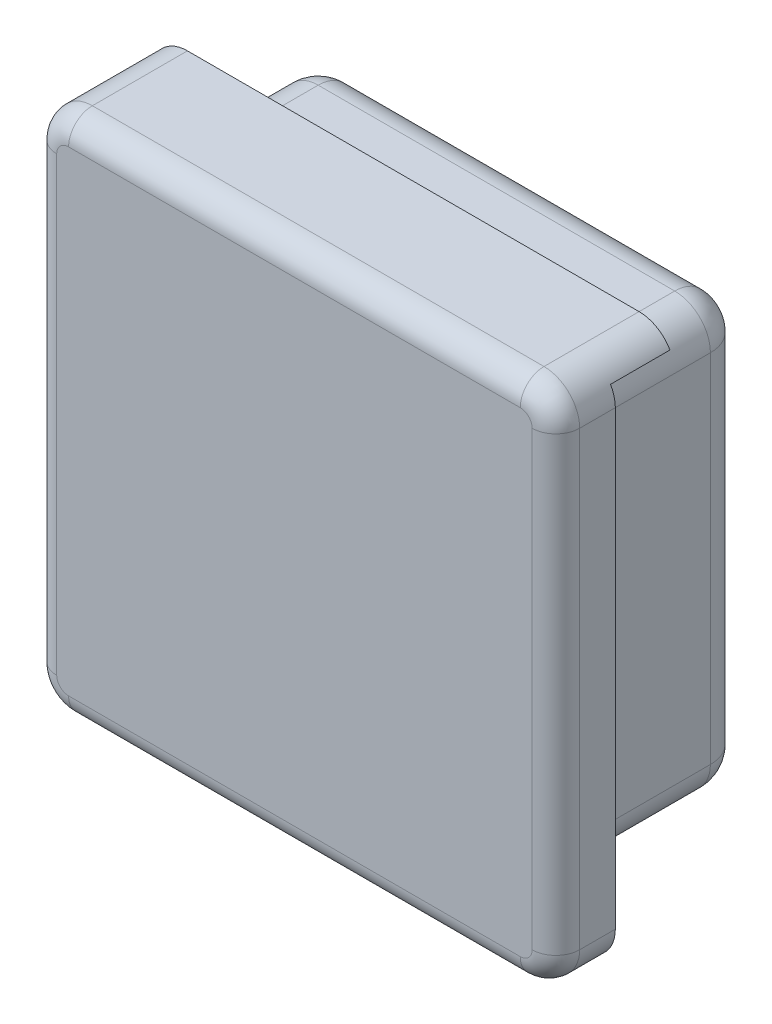
ISO-10303-21;
HEADER;
FILE_DESCRIPTION(('STEP AP214'),'2;1');
FILE_NAME('part.step','',(''),(''),'','','');
FILE_SCHEMA(('AUTOMOTIVE_DESIGN { 1 0 10303 214 1 1 1 1 }'));
ENDSEC;
DATA;
#1=APPLICATION_CONTEXT('core data for automotive mechanical design processes');
#2=APPLICATION_PROTOCOL_DEFINITION('international standard','automotive_design',2000,#1);
#3=PRODUCT_CONTEXT('',#1,'mechanical');
#4=PRODUCT('Part','Part','',(#3));
#5=PRODUCT_RELATED_PRODUCT_CATEGORY('part','',(#4));
#6=PRODUCT_DEFINITION_FORMATION('','',#4);
#7=PRODUCT_DEFINITION_CONTEXT('part definition',#1,'design');
#8=PRODUCT_DEFINITION('design','',#6,#7);
#9=PRODUCT_DEFINITION_SHAPE('','',#8);
#10=(LENGTH_UNIT() NAMED_UNIT(*) SI_UNIT(.MILLI.,.METRE.));
#11=(NAMED_UNIT(*) PLANE_ANGLE_UNIT() SI_UNIT($,.RADIAN.));
#12=(NAMED_UNIT(*) SI_UNIT($,.STERADIAN.) SOLID_ANGLE_UNIT());
#13=UNCERTAINTY_MEASURE_WITH_UNIT(LENGTH_MEASURE(1.E-05),#10,'distance_accuracy_value','');
#14=(GEOMETRIC_REPRESENTATION_CONTEXT(3) GLOBAL_UNCERTAINTY_ASSIGNED_CONTEXT((#13)) GLOBAL_UNIT_ASSIGNED_CONTEXT((#10,
#11,#12)) REPRESENTATION_CONTEXT('',''));
#15=CARTESIAN_POINT('',(0.,0.,0.));
#16=DIRECTION('',(0.,0.,1.));
#17=DIRECTION('',(1.,0.,0.));
#18=AXIS2_PLACEMENT_3D('',#15,#16,#17);
#19=CARTESIAN_POINT('',(0.,0.,0.));
#20=DIRECTION('',(0.,0.,-1.));
#21=DIRECTION('',(-1.,0.,0.));
#22=AXIS2_PLACEMENT_3D('',#19,#20,#21);
#23=PLANE('',#22);
#24=DIRECTION('',(-1.,0.,0.));
#25=VECTOR('',#24,1.);
#26=CARTESIAN_POINT('',(0.,44.,0.));
#27=LINE('',#26,#25);
#28=CARTESIAN_POINT('',(41.,44.,0.));
#29=VERTEX_POINT('',#28);
#30=CARTESIAN_POINT('',(3.,44.,0.));
#31=VERTEX_POINT('',#30);
#32=EDGE_CURVE('E240',#29,#31,#27,.T.);
#33=ORIENTED_EDGE('',*,*,#32,.F.);
#34=CARTESIAN_POINT('',(41.,41.,0.));
#35=DIRECTION('',(0.,0.,-1.));
#36=DIRECTION('',(-1.,0.,0.));
#37=AXIS2_PLACEMENT_3D('',#34,#35,#36);
#38=CIRCLE('',#37,3.);
#39=CARTESIAN_POINT('',(43.5980762113533,42.5,0.));
#40=VERTEX_POINT('',#39);
#41=EDGE_CURVE('E298',#29,#40,#38,.T.);
#42=ORIENTED_EDGE('',*,*,#41,.T.);
#43=DIRECTION('',(1.,0.,0.));
#44=VECTOR('',#43,1.);
#45=CARTESIAN_POINT('',(44.,42.5,0.));
#46=LINE('',#45,#44);
#47=CARTESIAN_POINT('',(4.5,42.5,0.));
#48=VERTEX_POINT('',#47);
#49=EDGE_CURVE('E421',#48,#40,#46,.T.);
#50=ORIENTED_EDGE('',*,*,#49,.F.);
#51=CARTESIAN_POINT('',(4.5,39.5,0.));
#52=DIRECTION('',(0.,0.,-1.));
#53=DIRECTION('',(-1.,0.,0.));
#54=AXIS2_PLACEMENT_3D('',#51,#52,#53);
#55=CIRCLE('',#54,3.);
#56=CARTESIAN_POINT('',(1.5,39.5,0.));
#57=VERTEX_POINT('',#56);
#58=EDGE_CURVE('E314',#48,#57,#55,.F.);
#59=ORIENTED_EDGE('',*,*,#58,.T.);
#60=DIRECTION('',(0.,1.,0.));
#61=VECTOR('',#60,1.);
#62=CARTESIAN_POINT('',(1.5,42.5,0.));
#63=LINE('',#62,#61);
#64=CARTESIAN_POINT('',(1.5,0.401923788646685,0.));
#65=VERTEX_POINT('',#64);
#66=EDGE_CURVE('E427',#65,#57,#63,.T.);
#67=ORIENTED_EDGE('',*,*,#66,.F.);
#68=CARTESIAN_POINT('',(3.,3.,0.));
#69=DIRECTION('',(0.,0.,-1.));
#70=DIRECTION('',(-1.,0.,0.));
#71=AXIS2_PLACEMENT_3D('',#68,#69,#70);
#72=CIRCLE('',#71,3.);
#73=CARTESIAN_POINT('',(0.,3.,0.));
#74=VERTEX_POINT('',#73);
#75=EDGE_CURVE('E296',#65,#74,#72,.T.);
#76=ORIENTED_EDGE('',*,*,#75,.T.);
#77=DIRECTION('',(0.,-1.,0.));
#78=VECTOR('',#77,1.);
#79=CARTESIAN_POINT('',(0.,0.,0.));
#80=LINE('',#79,#78);
#81=CARTESIAN_POINT('',(0.,41.,0.));
#82=VERTEX_POINT('',#81);
#83=EDGE_CURVE('E438',#82,#74,#80,.T.);
#84=ORIENTED_EDGE('',*,*,#83,.F.);
#85=CARTESIAN_POINT('',(3.,41.,0.));
#86=DIRECTION('',(0.,0.,-1.));
#87=DIRECTION('',(-1.,0.,0.));
#88=AXIS2_PLACEMENT_3D('',#85,#86,#87);
#89=CIRCLE('',#88,3.);
#90=EDGE_CURVE('E294',#82,#31,#89,.T.);
#91=ORIENTED_EDGE('',*,*,#90,.T.);
#92=EDGE_LOOP('',(#33,#42,#50,#59,#67,#76,#84,#91));
#93=FACE_BOUND('',#92,.T.);
#94=ADVANCED_FACE('F35',(#93),#23,.T.);
#95=CARTESIAN_POINT('',(0.,0.,10.));
#96=DIRECTION('',(1.,0.,0.));
#97=DIRECTION('',(0.,0.,-1.));
#98=AXIS2_PLACEMENT_3D('',#95,#96,#97);
#99=PLANE('',#98);
#100=DIRECTION('',(0.,0.,-1.));
#101=VECTOR('',#100,1.);
#102=CARTESIAN_POINT('',(0.,3.,10.));
#103=LINE('',#102,#101);
#104=CARTESIAN_POINT('',(0.,3.,8.));
#105=VERTEX_POINT('',#104);
#106=EDGE_CURVE('E311',#74,#105,#103,.F.);
#107=ORIENTED_EDGE('',*,*,#106,.T.);
#108=DIRECTION('',(0.,-1.,0.));
#109=VECTOR('',#108,1.);
#110=CARTESIAN_POINT('',(0.,0.,8.));
#111=LINE('',#110,#109);
#112=CARTESIAN_POINT('',(0.,41.,8.));
#113=VERTEX_POINT('',#112);
#114=EDGE_CURVE('E368',#105,#113,#111,.F.);
#115=ORIENTED_EDGE('',*,*,#114,.T.);
#116=DIRECTION('',(0.,0.,-1.));
#117=VECTOR('',#116,1.);
#118=CARTESIAN_POINT('',(0.,41.,10.));
#119=LINE('',#118,#117);
#120=EDGE_CURVE('E309',#113,#82,#119,.T.);
#121=ORIENTED_EDGE('',*,*,#120,.T.);
#122=ORIENTED_EDGE('',*,*,#83,.T.);
#123=EDGE_LOOP('',(#107,#115,#121,#122));
#124=FACE_BOUND('',#123,.T.);
#125=ADVANCED_FACE('F514',(#124),#99,.F.);
#126=CARTESIAN_POINT('',(0.,0.,10.));
#127=DIRECTION('',(0.,1.,0.));
#128=DIRECTION('',(0.,0.,1.));
#129=AXIS2_PLACEMENT_3D('',#126,#127,#128);
#130=PLANE('',#129);
#131=DIRECTION('',(0.,0.,-1.));
#132=VECTOR('',#131,1.);
#133=CARTESIAN_POINT('',(41.,0.,10.));
#134=LINE('',#133,#132);
#135=CARTESIAN_POINT('',(41.,0.,5.));
#136=VERTEX_POINT('',#135);
#137=CARTESIAN_POINT('',(41.,0.,8.));
#138=VERTEX_POINT('',#137);
#139=EDGE_CURVE('E287',#136,#138,#134,.F.);
#140=ORIENTED_EDGE('',*,*,#139,.T.);
#141=DIRECTION('',(1.,0.,0.));
#142=VECTOR('',#141,1.);
#143=CARTESIAN_POINT('',(0.,0.,8.));
#144=LINE('',#143,#142);
#145=CARTESIAN_POINT('',(3.,0.,8.));
#146=VERTEX_POINT('',#145);
#147=EDGE_CURVE('E11',#138,#146,#144,.F.);
#148=ORIENTED_EDGE('',*,*,#147,.T.);
#149=DIRECTION('',(0.,0.,-1.));
#150=VECTOR('',#149,1.);
#151=CARTESIAN_POINT('',(3.,0.,10.));
#152=LINE('',#151,#150);
#153=CARTESIAN_POINT('',(3.,0.,5.));
#154=VERTEX_POINT('',#153);
#155=EDGE_CURVE('E285',#146,#154,#152,.T.);
#156=ORIENTED_EDGE('',*,*,#155,.T.);
#157=DIRECTION('',(-1.,0.,0.));
#158=VECTOR('',#157,1.);
#159=CARTESIAN_POINT('',(1.5,0.,5.));
#160=LINE('',#159,#158);
#161=EDGE_CURVE('E420',#136,#154,#160,.T.);
#162=ORIENTED_EDGE('',*,*,#161,.F.);
#163=EDGE_LOOP('',(#140,#148,#156,#162));
#164=FACE_BOUND('',#163,.T.);
#165=ADVANCED_FACE('F520',(#164),#130,.F.);
#166=CARTESIAN_POINT('',(44.,0.,10.));
#167=DIRECTION('',(-1.,0.,0.));
#168=DIRECTION('',(0.,0.,1.));
#169=AXIS2_PLACEMENT_3D('',#166,#167,#168);
#170=PLANE('',#169);
#171=DIRECTION('',(0.,0.,-1.));
#172=VECTOR('',#171,1.);
#173=CARTESIAN_POINT('',(44.,41.,10.));
#174=LINE('',#173,#172);
#175=CARTESIAN_POINT('',(44.,41.,5.));
#176=VERTEX_POINT('',#175);
#177=CARTESIAN_POINT('',(44.,41.,8.));
#178=VERTEX_POINT('',#177);
#179=EDGE_CURVE('E273',#176,#178,#174,.F.);
#180=ORIENTED_EDGE('',*,*,#179,.T.);
#181=DIRECTION('',(0.,1.,0.));
#182=VECTOR('',#181,1.);
#183=CARTESIAN_POINT('',(44.,0.,8.));
#184=LINE('',#183,#182);
#185=CARTESIAN_POINT('',(44.,3.,8.));
#186=VERTEX_POINT('',#185);
#187=EDGE_CURVE('E59',#178,#186,#184,.F.);
#188=ORIENTED_EDGE('',*,*,#187,.T.);
#189=DIRECTION('',(0.,0.,-1.));
#190=VECTOR('',#189,1.);
#191=CARTESIAN_POINT('',(44.,3.,10.));
#192=LINE('',#191,#190);
#193=CARTESIAN_POINT('',(44.,3.,5.));
#194=VERTEX_POINT('',#193);
#195=EDGE_CURVE('E275',#186,#194,#192,.T.);
#196=ORIENTED_EDGE('',*,*,#195,.T.);
#197=DIRECTION('',(0.,-1.,0.));
#198=VECTOR('',#197,1.);
#199=CARTESIAN_POINT('',(44.,0.,5.));
#200=LINE('',#199,#198);
#201=EDGE_CURVE('E417',#176,#194,#200,.T.);
#202=ORIENTED_EDGE('',*,*,#201,.F.);
#203=EDGE_LOOP('',(#180,#188,#196,#202));
#204=FACE_BOUND('',#203,.T.);
#205=ADVANCED_FACE('F415',(#204),#170,.F.);
#206=CARTESIAN_POINT('',(0.,44.,10.));
#207=DIRECTION('',(0.,-1.,0.));
#208=DIRECTION('',(0.,0.,-1.));
#209=AXIS2_PLACEMENT_3D('',#206,#207,#208);
#210=PLANE('',#209);
#211=DIRECTION('',(0.,0.,-1.));
#212=VECTOR('',#211,1.);
#213=CARTESIAN_POINT('',(3.,44.,10.));
#214=LINE('',#213,#212);
#215=CARTESIAN_POINT('',(3.,44.,8.));
#216=VERTEX_POINT('',#215);
#217=EDGE_CURVE('E289',#31,#216,#214,.F.);
#218=ORIENTED_EDGE('',*,*,#217,.T.);
#219=DIRECTION('',(-1.,0.,0.));
#220=VECTOR('',#219,1.);
#221=CARTESIAN_POINT('',(0.,44.,8.));
#222=LINE('',#221,#220);
#223=CARTESIAN_POINT('',(41.,44.,8.));
#224=VERTEX_POINT('',#223);
#225=EDGE_CURVE('E372',#216,#224,#222,.F.);
#226=ORIENTED_EDGE('',*,*,#225,.T.);
#227=DIRECTION('',(0.,0.,-1.));
#228=VECTOR('',#227,1.);
#229=CARTESIAN_POINT('',(41.,44.,10.));
#230=LINE('',#229,#228);
#231=EDGE_CURVE('E292',#224,#29,#230,.T.);
#232=ORIENTED_EDGE('',*,*,#231,.T.);
#233=ORIENTED_EDGE('',*,*,#32,.T.);
#234=EDGE_LOOP('',(#218,#226,#232,#233));
#235=FACE_BOUND('',#234,.T.);
#236=ADVANCED_FACE('F528',(#235),#210,.F.);
#237=CARTESIAN_POINT('',(0.,0.,10.));
#238=DIRECTION('',(0.,0.,-1.));
#239=DIRECTION('',(-1.,0.,0.));
#240=AXIS2_PLACEMENT_3D('',#237,#238,#239);
#241=PLANE('',#240);
#242=DIRECTION('',(0.,-1.,0.));
#243=VECTOR('',#242,1.);
#244=CARTESIAN_POINT('',(2.,0.,10.));
#245=LINE('',#244,#243);
#246=CARTESIAN_POINT('',(2.,41.,10.));
#247=VERTEX_POINT('',#246);
#248=CARTESIAN_POINT('',(2.,3.,10.));
#249=VERTEX_POINT('',#248);
#250=EDGE_CURVE('E360',#247,#249,#245,.T.);
#251=ORIENTED_EDGE('',*,*,#250,.T.);
#252=CARTESIAN_POINT('',(3.,3.,10.));
#253=DIRECTION('',(0.,0.,-1.));
#254=DIRECTION('',(-1.,0.,0.));
#255=AXIS2_PLACEMENT_3D('',#252,#253,#254);
#256=CIRCLE('',#255,1.);
#257=CARTESIAN_POINT('',(3.,2.,10.));
#258=VERTEX_POINT('',#257);
#259=EDGE_CURVE('E362',#249,#258,#256,.F.);
#260=ORIENTED_EDGE('',*,*,#259,.T.);
#261=DIRECTION('',(1.,0.,0.));
#262=VECTOR('',#261,1.);
#263=CARTESIAN_POINT('',(0.,2.,10.));
#264=LINE('',#263,#262);
#265=CARTESIAN_POINT('',(41.,2.,10.));
#266=VERTEX_POINT('',#265);
#267=EDGE_CURVE('E323',#258,#266,#264,.T.);
#268=ORIENTED_EDGE('',*,*,#267,.T.);
#269=CARTESIAN_POINT('',(41.,3.,10.));
#270=DIRECTION('',(0.,0.,-1.));
#271=DIRECTION('',(-1.,0.,0.));
#272=AXIS2_PLACEMENT_3D('',#269,#270,#271);
#273=CIRCLE('',#272,1.);
#274=CARTESIAN_POINT('',(42.,3.,10.));
#275=VERTEX_POINT('',#274);
#276=EDGE_CURVE('E350',#266,#275,#273,.F.);
#277=ORIENTED_EDGE('',*,*,#276,.T.);
#278=DIRECTION('',(0.,1.,0.));
#279=VECTOR('',#278,1.);
#280=CARTESIAN_POINT('',(42.,0.,10.));
#281=LINE('',#280,#279);
#282=CARTESIAN_POINT('',(42.,41.,10.));
#283=VERTEX_POINT('',#282);
#284=EDGE_CURVE('E352',#275,#283,#281,.T.);
#285=ORIENTED_EDGE('',*,*,#284,.T.);
#286=CARTESIAN_POINT('',(41.,41.,10.));
#287=DIRECTION('',(0.,0.,-1.));
#288=DIRECTION('',(-1.,0.,0.));
#289=AXIS2_PLACEMENT_3D('',#286,#287,#288);
#290=CIRCLE('',#289,1.);
#291=CARTESIAN_POINT('',(41.,42.,10.));
#292=VERTEX_POINT('',#291);
#293=EDGE_CURVE('E354',#283,#292,#290,.F.);
#294=ORIENTED_EDGE('',*,*,#293,.T.);
#295=DIRECTION('',(-1.,0.,0.));
#296=VECTOR('',#295,1.);
#297=CARTESIAN_POINT('',(0.,42.,10.));
#298=LINE('',#297,#296);
#299=CARTESIAN_POINT('',(3.,42.,10.));
#300=VERTEX_POINT('',#299);
#301=EDGE_CURVE('E356',#292,#300,#298,.T.);
#302=ORIENTED_EDGE('',*,*,#301,.T.);
#303=CARTESIAN_POINT('',(3.,41.,10.));
#304=DIRECTION('',(0.,0.,-1.));
#305=DIRECTION('',(-1.,0.,0.));
#306=AXIS2_PLACEMENT_3D('',#303,#304,#305);
#307=CIRCLE('',#306,1.);
#308=EDGE_CURVE('E358',#300,#247,#307,.F.);
#309=ORIENTED_EDGE('',*,*,#308,.T.);
#310=EDGE_LOOP('',(#251,#260,#268,#277,#285,#294,#302,#309));
#311=FACE_BOUND('',#310,.T.);
#312=ADVANCED_FACE('F526',(#311),#241,.F.);
#313=CARTESIAN_POINT('',(44.,42.5,5.));
#314=DIRECTION('',(0.,1.,0.));
#315=DIRECTION('',(0.,0.,1.));
#316=AXIS2_PLACEMENT_3D('',#313,#314,#315);
#317=PLANE('',#316);
#318=ORIENTED_EDGE('',*,*,#49,.T.);
#319=DIRECTION('',(0.,0.,-1.));
#320=VECTOR('',#319,1.);
#321=CARTESIAN_POINT('',(43.5980762113533,42.5,0.));
#322=LINE('',#321,#320);
#323=CARTESIAN_POINT('',(43.5980762113533,42.5,5.));
#324=VERTEX_POINT('',#323);
#325=EDGE_CURVE('E303',#40,#324,#322,.F.);
#326=ORIENTED_EDGE('',*,*,#325,.T.);
#327=DIRECTION('',(1.,0.,0.));
#328=VECTOR('',#327,1.);
#329=CARTESIAN_POINT('',(44.,42.5,5.));
#330=LINE('',#329,#328);
#331=CARTESIAN_POINT('',(4.5,42.5,5.));
#332=VERTEX_POINT('',#331);
#333=EDGE_CURVE('E435',#332,#324,#330,.T.);
#334=ORIENTED_EDGE('',*,*,#333,.F.);
#335=DIRECTION('',(0.,0.,-1.));
#336=VECTOR('',#335,1.);
#337=CARTESIAN_POINT('',(4.5,42.5,0.));
#338=LINE('',#337,#336);
#339=EDGE_CURVE('E300',#332,#48,#338,.T.);
#340=ORIENTED_EDGE('',*,*,#339,.T.);
#341=EDGE_LOOP('',(#318,#326,#334,#340));
#342=FACE_BOUND('',#341,.T.);
#343=ADVANCED_FACE('F806',(#342),#317,.F.);
#344=CARTESIAN_POINT('',(1.5,42.5,5.));
#345=DIRECTION('',(-1.,0.,0.));
#346=DIRECTION('',(0.,-1.,0.));
#347=AXIS2_PLACEMENT_3D('',#344,#345,#346);
#348=PLANE('',#347);
#349=DIRECTION('',(0.,1.,0.));
#350=VECTOR('',#349,1.);
#351=CARTESIAN_POINT('',(1.5,42.5,5.));
#352=LINE('',#351,#350);
#353=CARTESIAN_POINT('',(1.5,0.401923788646688,5.));
#354=VERTEX_POINT('',#353);
#355=CARTESIAN_POINT('',(1.5,39.5,5.));
#356=VERTEX_POINT('',#355);
#357=EDGE_CURVE('E424',#354,#356,#352,.T.);
#358=ORIENTED_EDGE('',*,*,#357,.F.);
#359=DIRECTION('',(0.,0.,-1.));
#360=VECTOR('',#359,1.);
#361=CARTESIAN_POINT('',(1.5,0.401923788646687,5.));
#362=LINE('',#361,#360);
#363=EDGE_CURVE('E307',#354,#65,#362,.T.);
#364=ORIENTED_EDGE('',*,*,#363,.T.);
#365=ORIENTED_EDGE('',*,*,#66,.T.);
#366=DIRECTION('',(0.,0.,-1.));
#367=VECTOR('',#366,1.);
#368=CARTESIAN_POINT('',(1.5,39.5,5.));
#369=LINE('',#368,#367);
#370=EDGE_CURVE('E305',#57,#356,#369,.F.);
#371=ORIENTED_EDGE('',*,*,#370,.T.);
#372=EDGE_LOOP('',(#358,#364,#365,#371));
#373=FACE_BOUND('',#372,.T.);
#374=ADVANCED_FACE('F798',(#373),#348,.F.);
#375=CARTESIAN_POINT('',(0.,0.,5.));
#376=DIRECTION('',(0.,0.,1.));
#377=DIRECTION('',(1.,0.,0.));
#378=AXIS2_PLACEMENT_3D('',#375,#376,#377);
#379=PLANE('',#378);
#380=DIRECTION('',(0.,-1.,0.));
#381=VECTOR('',#380,1.);
#382=CARTESIAN_POINT('',(40.,4.,5.));
#383=LINE('',#382,#381);
#384=CARTESIAN_POINT('',(40.,37.,5.));
#385=VERTEX_POINT('',#384);
#386=CARTESIAN_POINT('',(40.,7.,5.));
#387=VERTEX_POINT('',#386);
#388=EDGE_CURVE('E348',#385,#387,#383,.T.);
#389=ORIENTED_EDGE('',*,*,#388,.F.);
#390=CARTESIAN_POINT('',(37.,37.,5.));
#391=DIRECTION('',(0.,0.,1.));
#392=DIRECTION('',(1.,0.,0.));
#393=AXIS2_PLACEMENT_3D('',#390,#391,#392);
#394=CIRCLE('',#393,3.);
#395=CARTESIAN_POINT('',(37.,40.,5.));
#396=VERTEX_POINT('',#395);
#397=EDGE_CURVE('E322',#385,#396,#394,.T.);
#398=ORIENTED_EDGE('',*,*,#397,.T.);
#399=DIRECTION('',(1.,0.,0.));
#400=VECTOR('',#399,1.);
#401=CARTESIAN_POINT('',(40.,40.,5.));
#402=LINE('',#401,#400);
#403=CARTESIAN_POINT('',(7.00000000000001,40.,5.));
#404=VERTEX_POINT('',#403);
#405=EDGE_CURVE('E430',#404,#396,#402,.T.);
#406=ORIENTED_EDGE('',*,*,#405,.F.);
#407=CARTESIAN_POINT('',(7.00000000000001,37.,5.));
#408=DIRECTION('',(0.,0.,1.));
#409=DIRECTION('',(1.,0.,0.));
#410=AXIS2_PLACEMENT_3D('',#407,#408,#409);
#411=CIRCLE('',#410,3.);
#412=CARTESIAN_POINT('',(4.,37.,5.));
#413=VERTEX_POINT('',#412);
#414=EDGE_CURVE('E318',#404,#413,#411,.T.);
#415=ORIENTED_EDGE('',*,*,#414,.T.);
#416=DIRECTION('',(0.,1.,0.));
#417=VECTOR('',#416,1.);
#418=CARTESIAN_POINT('',(4.,40.,5.));
#419=LINE('',#418,#417);
#420=CARTESIAN_POINT('',(4.,7.,5.));
#421=VERTEX_POINT('',#420);
#422=EDGE_CURVE('E486',#421,#413,#419,.T.);
#423=ORIENTED_EDGE('',*,*,#422,.F.);
#424=CARTESIAN_POINT('',(7.,7.,5.));
#425=DIRECTION('',(0.,0.,1.));
#426=DIRECTION('',(1.,0.,0.));
#427=AXIS2_PLACEMENT_3D('',#424,#425,#426);
#428=CIRCLE('',#427,3.);
#429=CARTESIAN_POINT('',(7.,4.,5.));
#430=VERTEX_POINT('',#429);
#431=EDGE_CURVE('E316',#421,#430,#428,.T.);
#432=ORIENTED_EDGE('',*,*,#431,.T.);
#433=DIRECTION('',(-1.,0.,0.));
#434=VECTOR('',#433,1.);
#435=CARTESIAN_POINT('',(4.,4.,5.));
#436=LINE('',#435,#434);
#437=CARTESIAN_POINT('',(37.,4.,5.));
#438=VERTEX_POINT('',#437);
#439=EDGE_CURVE('E483',#438,#430,#436,.T.);
#440=ORIENTED_EDGE('',*,*,#439,.F.);
#441=CARTESIAN_POINT('',(37.,7.,5.));
#442=DIRECTION('',(0.,0.,1.));
#443=DIRECTION('',(1.,0.,0.));
#444=AXIS2_PLACEMENT_3D('',#441,#442,#443);
#445=CIRCLE('',#444,3.);
#446=EDGE_CURVE('E320',#438,#387,#445,.T.);
#447=ORIENTED_EDGE('',*,*,#446,.T.);
#448=EDGE_LOOP('',(#389,#398,#406,#415,#423,#432,#440,#447));
#449=FACE_BOUND('',#448,.T.);
#450=ORIENTED_EDGE('',*,*,#201,.T.);
#451=CARTESIAN_POINT('',(41.,3.,5.));
#452=DIRECTION('',(0.,0.,1.));
#453=DIRECTION('',(1.,0.,0.));
#454=AXIS2_PLACEMENT_3D('',#451,#452,#453);
#455=CIRCLE('',#454,3.);
#456=EDGE_CURVE('E283',#194,#136,#455,.F.);
#457=ORIENTED_EDGE('',*,*,#456,.T.);
#458=ORIENTED_EDGE('',*,*,#161,.T.);
#459=CARTESIAN_POINT('',(3.,3.,5.));
#460=DIRECTION('',(0.,0.,1.));
#461=DIRECTION('',(1.,0.,0.));
#462=AXIS2_PLACEMENT_3D('',#459,#460,#461);
#463=CIRCLE('',#462,3.);
#464=EDGE_CURVE('E279',#154,#354,#463,.F.);
#465=ORIENTED_EDGE('',*,*,#464,.T.);
#466=ORIENTED_EDGE('',*,*,#357,.T.);
#467=CARTESIAN_POINT('',(4.5,39.5,5.));
#468=DIRECTION('',(0.,0.,1.));
#469=DIRECTION('',(1.,0.,0.));
#470=AXIS2_PLACEMENT_3D('',#467,#468,#469);
#471=CIRCLE('',#470,3.);
#472=EDGE_CURVE('E277',#356,#332,#471,.F.);
#473=ORIENTED_EDGE('',*,*,#472,.T.);
#474=ORIENTED_EDGE('',*,*,#333,.T.);
#475=CARTESIAN_POINT('',(41.,41.,5.));
#476=DIRECTION('',(0.,0.,1.));
#477=DIRECTION('',(1.,0.,0.));
#478=AXIS2_PLACEMENT_3D('',#475,#476,#477);
#479=CIRCLE('',#478,3.);
#480=EDGE_CURVE('E281',#324,#176,#479,.F.);
#481=ORIENTED_EDGE('',*,*,#480,.T.);
#482=EDGE_LOOP('',(#450,#457,#458,#465,#466,#473,#474,#481));
#483=FACE_BOUND('',#482,.T.);
#484=ADVANCED_FACE('F480',(#449,#483),#379,.F.);
#485=CARTESIAN_POINT('',(0.,0.,-10.));
#486=DIRECTION('',(0.,0.,1.));
#487=DIRECTION('',(1.,0.,0.));
#488=AXIS2_PLACEMENT_3D('',#485,#486,#487);
#489=PLANE('',#488);
#490=DIRECTION('',(0.,1.,0.));
#491=VECTOR('',#490,1.);
#492=CARTESIAN_POINT('',(7.,0.,-10.));
#493=LINE('',#492,#491);
#494=CARTESIAN_POINT('',(7.,7.,-10.));
#495=VERTEX_POINT('',#494);
#496=CARTESIAN_POINT('',(7.,37.,-10.));
#497=VERTEX_POINT('',#496);
#498=EDGE_CURVE('E244',#495,#497,#493,.T.);
#499=ORIENTED_EDGE('',*,*,#498,.T.);
#500=DIRECTION('',(1.,0.,0.));
#501=VECTOR('',#500,1.);
#502=CARTESIAN_POINT('',(0.,37.,-10.));
#503=LINE('',#502,#501);
#504=CARTESIAN_POINT('',(37.,37.,-10.));
#505=VERTEX_POINT('',#504);
#506=EDGE_CURVE('E215',#497,#505,#503,.T.);
#507=ORIENTED_EDGE('',*,*,#506,.T.);
#508=DIRECTION('',(0.,-1.,0.));
#509=VECTOR('',#508,1.);
#510=CARTESIAN_POINT('',(37.,0.,-10.));
#511=LINE('',#510,#509);
#512=CARTESIAN_POINT('',(37.,7.,-10.));
#513=VERTEX_POINT('',#512);
#514=EDGE_CURVE('E233',#505,#513,#511,.T.);
#515=ORIENTED_EDGE('',*,*,#514,.T.);
#516=DIRECTION('',(-1.,0.,0.));
#517=VECTOR('',#516,1.);
#518=CARTESIAN_POINT('',(0.,7.,-10.));
#519=LINE('',#518,#517);
#520=EDGE_CURVE('E239',#513,#495,#519,.T.);
#521=ORIENTED_EDGE('',*,*,#520,.T.);
#522=EDGE_LOOP('',(#499,#507,#515,#521));
#523=FACE_BOUND('',#522,.T.);
#524=ADVANCED_FACE('F242',(#523),#489,.F.);
#525=CARTESIAN_POINT('',(40.,40.,-10.));
#526=DIRECTION('',(0.,-1.,0.));
#527=DIRECTION('',(0.,0.,-1.));
#528=AXIS2_PLACEMENT_3D('',#525,#526,#527);
#529=PLANE('',#528);
#530=DIRECTION('',(1.,0.,0.));
#531=VECTOR('',#530,1.);
#532=CARTESIAN_POINT('',(40.,40.,-7.));
#533=LINE('',#532,#531);
#534=CARTESIAN_POINT('',(37.,40.,-7.));
#535=VERTEX_POINT('',#534);
#536=CARTESIAN_POINT('',(7.00000000000001,40.,-7.));
#537=VERTEX_POINT('',#536);
#538=EDGE_CURVE('E217',#535,#537,#533,.F.);
#539=ORIENTED_EDGE('',*,*,#538,.T.);
#540=DIRECTION('',(0.,0.,1.));
#541=VECTOR('',#540,1.);
#542=CARTESIAN_POINT('',(7.00000000000001,40.,-10.));
#543=LINE('',#542,#541);
#544=EDGE_CURVE('E253',#537,#404,#543,.T.);
#545=ORIENTED_EDGE('',*,*,#544,.T.);
#546=ORIENTED_EDGE('',*,*,#405,.T.);
#547=DIRECTION('',(0.,0.,1.));
#548=VECTOR('',#547,1.);
#549=CARTESIAN_POINT('',(37.,40.,-10.));
#550=LINE('',#549,#548);
#551=EDGE_CURVE('E246',#396,#535,#550,.F.);
#552=ORIENTED_EDGE('',*,*,#551,.T.);
#553=EDGE_LOOP('',(#539,#545,#546,#552));
#554=FACE_BOUND('',#553,.T.);
#555=ADVANCED_FACE('F468',(#554),#529,.F.);
#556=CARTESIAN_POINT('',(4.,4.,-10.));
#557=DIRECTION('',(1.,0.,0.));
#558=DIRECTION('',(0.,1.,0.));
#559=AXIS2_PLACEMENT_3D('',#556,#557,#558);
#560=PLANE('',#559);
#561=DIRECTION('',(0.,1.,0.));
#562=VECTOR('',#561,1.);
#563=CARTESIAN_POINT('',(4.,4.,-7.));
#564=LINE('',#563,#562);
#565=CARTESIAN_POINT('',(4.,37.,-7.));
#566=VERTEX_POINT('',#565);
#567=CARTESIAN_POINT('',(4.,7.,-7.));
#568=VERTEX_POINT('',#567);
#569=EDGE_CURVE('E257',#566,#568,#564,.F.);
#570=ORIENTED_EDGE('',*,*,#569,.T.);
#571=DIRECTION('',(0.,0.,1.));
#572=VECTOR('',#571,1.);
#573=CARTESIAN_POINT('',(4.,7.,-10.));
#574=LINE('',#573,#572);
#575=EDGE_CURVE('E259',#568,#421,#574,.T.);
#576=ORIENTED_EDGE('',*,*,#575,.T.);
#577=ORIENTED_EDGE('',*,*,#422,.T.);
#578=DIRECTION('',(0.,0.,1.));
#579=VECTOR('',#578,1.);
#580=CARTESIAN_POINT('',(4.,37.,-10.));
#581=LINE('',#580,#579);
#582=EDGE_CURVE('E255',#413,#566,#581,.F.);
#583=ORIENTED_EDGE('',*,*,#582,.T.);
#584=EDGE_LOOP('',(#570,#576,#577,#583));
#585=FACE_BOUND('',#584,.T.);
#586=ADVANCED_FACE('F491',(#585),#560,.F.);
#587=CARTESIAN_POINT('',(40.,4.,-10.));
#588=DIRECTION('',(0.,1.,0.));
#589=DIRECTION('',(0.,0.,1.));
#590=AXIS2_PLACEMENT_3D('',#587,#588,#589);
#591=PLANE('',#590);
#592=ORIENTED_EDGE('',*,*,#439,.T.);
#593=DIRECTION('',(0.,0.,1.));
#594=VECTOR('',#593,1.);
#595=CARTESIAN_POINT('',(7.,4.,-10.));
#596=LINE('',#595,#594);
#597=CARTESIAN_POINT('',(7.,4.,-7.));
#598=VERTEX_POINT('',#597);
#599=EDGE_CURVE('E265',#430,#598,#596,.F.);
#600=ORIENTED_EDGE('',*,*,#599,.T.);
#601=DIRECTION('',(-1.,0.,0.));
#602=VECTOR('',#601,1.);
#603=CARTESIAN_POINT('',(40.,4.,-7.));
#604=LINE('',#603,#602);
#605=CARTESIAN_POINT('',(37.,4.,-7.));
#606=VERTEX_POINT('',#605);
#607=EDGE_CURVE('E263',#598,#606,#604,.F.);
#608=ORIENTED_EDGE('',*,*,#607,.T.);
#609=DIRECTION('',(0.,0.,1.));
#610=VECTOR('',#609,1.);
#611=CARTESIAN_POINT('',(37.,4.,-10.));
#612=LINE('',#611,#610);
#613=EDGE_CURVE('E261',#606,#438,#612,.T.);
#614=ORIENTED_EDGE('',*,*,#613,.T.);
#615=EDGE_LOOP('',(#592,#600,#608,#614));
#616=FACE_BOUND('',#615,.T.);
#617=ADVANCED_FACE('F498',(#616),#591,.F.);
#618=CARTESIAN_POINT('',(40.,4.,-10.));
#619=DIRECTION('',(-1.,0.,0.));
#620=DIRECTION('',(0.,0.,1.));
#621=AXIS2_PLACEMENT_3D('',#618,#619,#620);
#622=PLANE('',#621);
#623=ORIENTED_EDGE('',*,*,#388,.T.);
#624=DIRECTION('',(0.,0.,1.));
#625=VECTOR('',#624,1.);
#626=CARTESIAN_POINT('',(40.,7.,-10.));
#627=LINE('',#626,#625);
#628=CARTESIAN_POINT('',(40.,7.,-7.));
#629=VERTEX_POINT('',#628);
#630=EDGE_CURVE('E271',#387,#629,#627,.F.);
#631=ORIENTED_EDGE('',*,*,#630,.T.);
#632=DIRECTION('',(0.,-1.,0.));
#633=VECTOR('',#632,1.);
#634=CARTESIAN_POINT('',(40.,4.,-7.));
#635=LINE('',#634,#633);
#636=CARTESIAN_POINT('',(40.,37.,-7.));
#637=VERTEX_POINT('',#636);
#638=EDGE_CURVE('E269',#629,#637,#635,.F.);
#639=ORIENTED_EDGE('',*,*,#638,.T.);
#640=DIRECTION('',(0.,0.,1.));
#641=VECTOR('',#640,1.);
#642=CARTESIAN_POINT('',(40.,37.,-10.));
#643=LINE('',#642,#641);
#644=EDGE_CURVE('E267',#637,#385,#643,.T.);
#645=ORIENTED_EDGE('',*,*,#644,.T.);
#646=EDGE_LOOP('',(#623,#631,#639,#645));
#647=FACE_BOUND('',#646,.T.);
#648=ADVANCED_FACE('F477',(#647),#622,.F.);
#649=CARTESIAN_POINT('',(7.,7.,-10.));
#650=DIRECTION('',(0.,0.,1.));
#651=DIRECTION('',(1.,0.,0.));
#652=AXIS2_PLACEMENT_3D('',#649,#650,#651);
#653=CYLINDRICAL_SURFACE('',#652,3.);
#654=ORIENTED_EDGE('',*,*,#431,.F.);
#655=ORIENTED_EDGE('',*,*,#575,.F.);
#656=CARTESIAN_POINT('',(7.,7.,-7.));
#657=DIRECTION('',(0.,0.,-1.));
#658=DIRECTION('',(-1.,0.,0.));
#659=AXIS2_PLACEMENT_3D('',#656,#657,#658);
#660=CIRCLE('',#659,3.);
#661=EDGE_CURVE('E345',#598,#568,#660,.T.);
#662=ORIENTED_EDGE('',*,*,#661,.F.);
#663=ORIENTED_EDGE('',*,*,#599,.F.);
#664=EDGE_LOOP('',(#654,#655,#662,#663));
#665=FACE_BOUND('',#664,.T.);
#666=ADVANCED_FACE('F496',(#665),#653,.T.);
#667=CARTESIAN_POINT('',(0.,7.,-7.));
#668=DIRECTION('',(-1.,0.,0.));
#669=DIRECTION('',(0.,0.,1.));
#670=AXIS2_PLACEMENT_3D('',#667,#668,#669);
#671=CYLINDRICAL_SURFACE('',#670,3.);
#672=CARTESIAN_POINT('',(37.,7.,-7.));
#673=DIRECTION('',(1.,0.,0.));
#674=DIRECTION('',(0.,0.,-1.));
#675=AXIS2_PLACEMENT_3D('',#672,#673,#674);
#676=CIRCLE('',#675,3.);
#677=EDGE_CURVE('E339',#606,#513,#676,.T.);
#678=ORIENTED_EDGE('',*,*,#677,.F.);
#679=ORIENTED_EDGE('',*,*,#607,.F.);
#680=CARTESIAN_POINT('',(7.,7.,-7.));
#681=DIRECTION('',(-1.,0.,0.));
#682=DIRECTION('',(0.,0.,1.));
#683=AXIS2_PLACEMENT_3D('',#680,#681,#682);
#684=CIRCLE('',#683,3.);
#685=EDGE_CURVE('E342',#495,#598,#684,.T.);
#686=ORIENTED_EDGE('',*,*,#685,.F.);
#687=ORIENTED_EDGE('',*,*,#520,.F.);
#688=EDGE_LOOP('',(#678,#679,#686,#687));
#689=FACE_BOUND('',#688,.T.);
#690=ADVANCED_FACE('F449',(#689),#671,.T.);
#691=CARTESIAN_POINT('',(37.,7.,-10.));
#692=DIRECTION('',(0.,0.,1.));
#693=DIRECTION('',(1.,0.,0.));
#694=AXIS2_PLACEMENT_3D('',#691,#692,#693);
#695=CYLINDRICAL_SURFACE('',#694,3.);
#696=ORIENTED_EDGE('',*,*,#446,.F.);
#697=ORIENTED_EDGE('',*,*,#613,.F.);
#698=CARTESIAN_POINT('',(37.,7.,-7.));
#699=DIRECTION('',(0.,0.,-1.));
#700=DIRECTION('',(-1.,0.,0.));
#701=AXIS2_PLACEMENT_3D('',#698,#699,#700);
#702=CIRCLE('',#701,3.);
#703=EDGE_CURVE('E336',#629,#606,#702,.T.);
#704=ORIENTED_EDGE('',*,*,#703,.F.);
#705=ORIENTED_EDGE('',*,*,#630,.F.);
#706=EDGE_LOOP('',(#696,#697,#704,#705));
#707=FACE_BOUND('',#706,.T.);
#708=ADVANCED_FACE('F501',(#707),#695,.T.);
#709=CARTESIAN_POINT('',(7.,7.,-7.));
#710=DIRECTION('',(0.,0.,1.));
#711=DIRECTION('',(1.,0.,0.));
#712=AXIS2_PLACEMENT_3D('',#709,#710,#711);
#713=SPHERICAL_SURFACE('',#712,3.);
#714=ORIENTED_EDGE('',*,*,#685,.T.);
#715=ORIENTED_EDGE('',*,*,#661,.T.);
#716=CARTESIAN_POINT('',(7.,7.,-7.));
#717=DIRECTION('',(0.,-1.,0.));
#718=DIRECTION('',(1.,0.,0.));
#719=AXIS2_PLACEMENT_3D('',#716,#717,#718);
#720=CIRCLE('',#719,3.);
#721=EDGE_CURVE('E333',#495,#568,#720,.F.);
#722=ORIENTED_EDGE('',*,*,#721,.F.);
#723=EDGE_LOOP('',(#714,#715,#722));
#724=FACE_BOUND('',#723,.T.);
#725=ADVANCED_FACE('F452',(#724),#713,.T.);
#726=CARTESIAN_POINT('',(37.,7.,-7.));
#727=DIRECTION('',(0.,0.,1.));
#728=DIRECTION('',(1.,0.,0.));
#729=AXIS2_PLACEMENT_3D('',#726,#727,#728);
#730=SPHERICAL_SURFACE('',#729,3.);
#731=ORIENTED_EDGE('',*,*,#703,.T.);
#732=ORIENTED_EDGE('',*,*,#677,.T.);
#733=CARTESIAN_POINT('',(37.,7.,-7.));
#734=DIRECTION('',(0.,-1.,0.));
#735=DIRECTION('',(0.,0.,-1.));
#736=AXIS2_PLACEMENT_3D('',#733,#734,#735);
#737=CIRCLE('',#736,3.);
#738=EDGE_CURVE('E236',#629,#513,#737,.F.);
#739=ORIENTED_EDGE('',*,*,#738,.F.);
#740=EDGE_LOOP('',(#731,#732,#739));
#741=FACE_BOUND('',#740,.T.);
#742=ADVANCED_FACE('F504',(#741),#730,.T.);
#743=CARTESIAN_POINT('',(7.00000000000001,37.,-10.));
#744=DIRECTION('',(0.,0.,1.));
#745=DIRECTION('',(1.,0.,0.));
#746=AXIS2_PLACEMENT_3D('',#743,#744,#745);
#747=CYLINDRICAL_SURFACE('',#746,3.);
#748=ORIENTED_EDGE('',*,*,#414,.F.);
#749=ORIENTED_EDGE('',*,*,#544,.F.);
#750=CARTESIAN_POINT('',(7.,37.,-7.));
#751=DIRECTION('',(0.,0.,-1.));
#752=DIRECTION('',(-1.,0.,0.));
#753=AXIS2_PLACEMENT_3D('',#750,#751,#752);
#754=CIRCLE('',#753,3.);
#755=EDGE_CURVE('E329',#566,#537,#754,.T.);
#756=ORIENTED_EDGE('',*,*,#755,.F.);
#757=ORIENTED_EDGE('',*,*,#582,.F.);
#758=EDGE_LOOP('',(#748,#749,#756,#757));
#759=FACE_BOUND('',#758,.T.);
#760=ADVANCED_FACE('F464',(#759),#747,.T.);
#761=CARTESIAN_POINT('',(7.,0.,-7.));
#762=DIRECTION('',(0.,1.,0.));
#763=DIRECTION('',(-1.,0.,0.));
#764=AXIS2_PLACEMENT_3D('',#761,#762,#763);
#765=CYLINDRICAL_SURFACE('',#764,3.);
#766=ORIENTED_EDGE('',*,*,#721,.T.);
#767=ORIENTED_EDGE('',*,*,#569,.F.);
#768=CARTESIAN_POINT('',(7.,37.,-7.));
#769=DIRECTION('',(0.,1.,0.));
#770=DIRECTION('',(0.,0.,1.));
#771=AXIS2_PLACEMENT_3D('',#768,#769,#770);
#772=CIRCLE('',#771,3.);
#773=EDGE_CURVE('E230',#497,#566,#772,.T.);
#774=ORIENTED_EDGE('',*,*,#773,.F.);
#775=ORIENTED_EDGE('',*,*,#498,.F.);
#776=EDGE_LOOP('',(#766,#767,#774,#775));
#777=FACE_BOUND('',#776,.T.);
#778=ADVANCED_FACE('F455',(#777),#765,.T.);
#779=CARTESIAN_POINT('',(37.,0.,-7.));
#780=DIRECTION('',(0.,-1.,0.));
#781=DIRECTION('',(0.,0.,-1.));
#782=AXIS2_PLACEMENT_3D('',#779,#780,#781);
#783=CYLINDRICAL_SURFACE('',#782,3.);
#784=ORIENTED_EDGE('',*,*,#738,.T.);
#785=ORIENTED_EDGE('',*,*,#514,.F.);
#786=CARTESIAN_POINT('',(37.,37.,-7.));
#787=DIRECTION('',(0.,1.,0.));
#788=DIRECTION('',(0.,0.,1.));
#789=AXIS2_PLACEMENT_3D('',#786,#787,#788);
#790=CIRCLE('',#789,3.);
#791=EDGE_CURVE('E223',#637,#505,#790,.T.);
#792=ORIENTED_EDGE('',*,*,#791,.F.);
#793=ORIENTED_EDGE('',*,*,#638,.F.);
#794=EDGE_LOOP('',(#784,#785,#792,#793));
#795=FACE_BOUND('',#794,.T.);
#796=ADVANCED_FACE('F234',(#795),#783,.T.);
#797=CARTESIAN_POINT('',(37.,37.,-10.));
#798=DIRECTION('',(0.,0.,1.));
#799=DIRECTION('',(1.,0.,0.));
#800=AXIS2_PLACEMENT_3D('',#797,#798,#799);
#801=CYLINDRICAL_SURFACE('',#800,3.);
#802=ORIENTED_EDGE('',*,*,#397,.F.);
#803=ORIENTED_EDGE('',*,*,#644,.F.);
#804=CARTESIAN_POINT('',(37.,37.,-7.));
#805=DIRECTION('',(0.,0.,-1.));
#806=DIRECTION('',(-1.,0.,0.));
#807=AXIS2_PLACEMENT_3D('',#804,#805,#806);
#808=CIRCLE('',#807,3.);
#809=EDGE_CURVE('E227',#535,#637,#808,.T.);
#810=ORIENTED_EDGE('',*,*,#809,.F.);
#811=ORIENTED_EDGE('',*,*,#551,.F.);
#812=EDGE_LOOP('',(#802,#803,#810,#811));
#813=FACE_BOUND('',#812,.T.);
#814=ADVANCED_FACE('F473',(#813),#801,.T.);
#815=CARTESIAN_POINT('',(7.,37.,-7.));
#816=DIRECTION('',(0.,0.,1.));
#817=DIRECTION('',(1.,0.,0.));
#818=AXIS2_PLACEMENT_3D('',#815,#816,#817);
#819=SPHERICAL_SURFACE('',#818,3.);
#820=ORIENTED_EDGE('',*,*,#773,.T.);
#821=ORIENTED_EDGE('',*,*,#755,.T.);
#822=CARTESIAN_POINT('',(7.00000000000001,37.,-7.));
#823=DIRECTION('',(-1.,0.,0.));
#824=DIRECTION('',(0.,0.,1.));
#825=AXIS2_PLACEMENT_3D('',#822,#823,#824);
#826=CIRCLE('',#825,3.);
#827=EDGE_CURVE('E220',#497,#537,#826,.F.);
#828=ORIENTED_EDGE('',*,*,#827,.F.);
#829=EDGE_LOOP('',(#820,#821,#828));
#830=FACE_BOUND('',#829,.T.);
#831=ADVANCED_FACE('F459',(#830),#819,.T.);
#832=CARTESIAN_POINT('',(37.,37.,-7.));
#833=DIRECTION('',(0.,0.,1.));
#834=DIRECTION('',(1.,0.,0.));
#835=AXIS2_PLACEMENT_3D('',#832,#833,#834);
#836=SPHERICAL_SURFACE('',#835,3.);
#837=ORIENTED_EDGE('',*,*,#809,.T.);
#838=ORIENTED_EDGE('',*,*,#791,.T.);
#839=CARTESIAN_POINT('',(37.,37.,-7.));
#840=DIRECTION('',(1.,0.,0.));
#841=DIRECTION('',(0.,0.,-1.));
#842=AXIS2_PLACEMENT_3D('',#839,#840,#841);
#843=CIRCLE('',#842,3.);
#844=EDGE_CURVE('E211',#535,#505,#843,.F.);
#845=ORIENTED_EDGE('',*,*,#844,.F.);
#846=EDGE_LOOP('',(#837,#838,#845));
#847=FACE_BOUND('',#846,.T.);
#848=ADVANCED_FACE('F225',(#847),#836,.T.);
#849=CARTESIAN_POINT('',(0.,37.,-7.));
#850=DIRECTION('',(1.,0.,0.));
#851=DIRECTION('',(0.,0.,-1.));
#852=AXIS2_PLACEMENT_3D('',#849,#850,#851);
#853=CYLINDRICAL_SURFACE('',#852,3.);
#854=ORIENTED_EDGE('',*,*,#827,.T.);
#855=ORIENTED_EDGE('',*,*,#538,.F.);
#856=ORIENTED_EDGE('',*,*,#844,.T.);
#857=ORIENTED_EDGE('',*,*,#506,.F.);
#858=EDGE_LOOP('',(#854,#855,#856,#857));
#859=FACE_BOUND('',#858,.T.);
#860=ADVANCED_FACE('F213',(#859),#853,.T.);
#861=CARTESIAN_POINT('',(41.,3.,10.));
#862=DIRECTION('',(0.,0.,-1.));
#863=DIRECTION('',(-1.,0.,0.));
#864=AXIS2_PLACEMENT_3D('',#861,#862,#863);
#865=CYLINDRICAL_SURFACE('',#864,3.);
#866=ORIENTED_EDGE('',*,*,#195,.F.);
#867=CARTESIAN_POINT('',(41.,3.,8.));
#868=DIRECTION('',(0.,0.,-1.));
#869=DIRECTION('',(-1.,0.,0.));
#870=AXIS2_PLACEMENT_3D('',#867,#868,#869);
#871=CIRCLE('',#870,3.);
#872=EDGE_CURVE('E44',#186,#138,#871,.T.);
#873=ORIENTED_EDGE('',*,*,#872,.T.);
#874=ORIENTED_EDGE('',*,*,#139,.F.);
#875=ORIENTED_EDGE('',*,*,#456,.F.);
#876=EDGE_LOOP('',(#866,#873,#874,#875));
#877=FACE_BOUND('',#876,.T.);
#878=ADVANCED_FACE('F539',(#877),#865,.T.);
#879=CARTESIAN_POINT('',(41.,41.,10.));
#880=DIRECTION('',(0.,0.,-1.));
#881=DIRECTION('',(-1.,0.,0.));
#882=AXIS2_PLACEMENT_3D('',#879,#880,#881);
#883=CYLINDRICAL_SURFACE('',#882,3.);
#884=ORIENTED_EDGE('',*,*,#231,.F.);
#885=CARTESIAN_POINT('',(41.,41.,8.));
#886=DIRECTION('',(0.,0.,-1.));
#887=DIRECTION('',(-1.,0.,0.));
#888=AXIS2_PLACEMENT_3D('',#885,#886,#887);
#889=CIRCLE('',#888,3.);
#890=EDGE_CURVE('E374',#224,#178,#889,.T.);
#891=ORIENTED_EDGE('',*,*,#890,.T.);
#892=ORIENTED_EDGE('',*,*,#179,.F.);
#893=ORIENTED_EDGE('',*,*,#480,.F.);
#894=ORIENTED_EDGE('',*,*,#325,.F.);
#895=ORIENTED_EDGE('',*,*,#41,.F.);
#896=EDGE_LOOP('',(#884,#891,#892,#893,#894,#895));
#897=FACE_BOUND('',#896,.T.);
#898=ADVANCED_FACE('F411',(#897),#883,.T.);
#899=CARTESIAN_POINT('',(3.,3.,10.));
#900=DIRECTION('',(0.,0.,-1.));
#901=DIRECTION('',(-1.,0.,0.));
#902=AXIS2_PLACEMENT_3D('',#899,#900,#901);
#903=CYLINDRICAL_SURFACE('',#902,3.);
#904=ORIENTED_EDGE('',*,*,#155,.F.);
#905=CARTESIAN_POINT('',(3.,3.,8.));
#906=DIRECTION('',(0.,0.,-1.));
#907=DIRECTION('',(-1.,0.,0.));
#908=AXIS2_PLACEMENT_3D('',#905,#906,#907);
#909=CIRCLE('',#908,3.);
#910=EDGE_CURVE('E365',#146,#105,#909,.T.);
#911=ORIENTED_EDGE('',*,*,#910,.T.);
#912=ORIENTED_EDGE('',*,*,#106,.F.);
#913=ORIENTED_EDGE('',*,*,#75,.F.);
#914=ORIENTED_EDGE('',*,*,#363,.F.);
#915=ORIENTED_EDGE('',*,*,#464,.F.);
#916=EDGE_LOOP('',(#904,#911,#912,#913,#914,#915));
#917=FACE_BOUND('',#916,.T.);
#918=ADVANCED_FACE('F587',(#917),#903,.T.);
#919=CARTESIAN_POINT('',(3.,41.,10.));
#920=DIRECTION('',(0.,0.,-1.));
#921=DIRECTION('',(-1.,0.,0.));
#922=AXIS2_PLACEMENT_3D('',#919,#920,#921);
#923=CYLINDRICAL_SURFACE('',#922,3.);
#924=ORIENTED_EDGE('',*,*,#120,.F.);
#925=CARTESIAN_POINT('',(3.,41.,8.));
#926=DIRECTION('',(0.,0.,-1.));
#927=DIRECTION('',(-1.,0.,0.));
#928=AXIS2_PLACEMENT_3D('',#925,#926,#927);
#929=CIRCLE('',#928,3.);
#930=EDGE_CURVE('E370',#113,#216,#929,.T.);
#931=ORIENTED_EDGE('',*,*,#930,.T.);
#932=ORIENTED_EDGE('',*,*,#217,.F.);
#933=ORIENTED_EDGE('',*,*,#90,.F.);
#934=EDGE_LOOP('',(#924,#931,#932,#933));
#935=FACE_BOUND('',#934,.T.);
#936=ADVANCED_FACE('F594',(#935),#923,.T.);
#937=CARTESIAN_POINT('',(4.5,39.5,5.));
#938=DIRECTION('',(0.,0.,1.));
#939=DIRECTION('',(1.,0.,0.));
#940=AXIS2_PLACEMENT_3D('',#937,#938,#939);
#941=CYLINDRICAL_SURFACE('',#940,3.);
#942=ORIENTED_EDGE('',*,*,#472,.F.);
#943=ORIENTED_EDGE('',*,*,#370,.F.);
#944=ORIENTED_EDGE('',*,*,#58,.F.);
#945=ORIENTED_EDGE('',*,*,#339,.F.);
#946=EDGE_LOOP('',(#942,#943,#944,#945));
#947=FACE_BOUND('',#946,.T.);
#948=ADVANCED_FACE('F602',(#947),#941,.F.);
#949=CARTESIAN_POINT('',(41.,41.,8.));
#950=DIRECTION('',(0.,0.,-1.));
#951=DIRECTION('',(-1.,0.,0.));
#952=AXIS2_PLACEMENT_3D('',#949,#950,#951);
#953=DEGENERATE_TOROIDAL_SURFACE('',#952,1.,2.,.T.);
#954=CARTESIAN_POINT('',(42.,41.,8.));
#955=DIRECTION('',(0.,-1.,0.));
#956=DIRECTION('',(0.,0.,-1.));
#957=AXIS2_PLACEMENT_3D('',#954,#955,#956);
#958=CIRCLE('',#957,2.);
#959=EDGE_CURVE('E393',#178,#283,#958,.T.);
#960=ORIENTED_EDGE('',*,*,#959,.F.);
#961=ORIENTED_EDGE('',*,*,#890,.F.);
#962=CARTESIAN_POINT('',(41.,42.,8.));
#963=DIRECTION('',(-1.,0.,0.));
#964=DIRECTION('',(0.,0.,1.));
#965=AXIS2_PLACEMENT_3D('',#962,#963,#964);
#966=CIRCLE('',#965,2.);
#967=EDGE_CURVE('E39',#292,#224,#966,.T.);
#968=ORIENTED_EDGE('',*,*,#967,.F.);
#969=ORIENTED_EDGE('',*,*,#293,.F.);
#970=EDGE_LOOP('',(#960,#961,#968,#969));
#971=FACE_BOUND('',#970,.T.);
#972=ADVANCED_FACE('F37',(#971),#953,.T.);
#973=CARTESIAN_POINT('',(0.,42.,8.));
#974=DIRECTION('',(-1.,0.,0.));
#975=DIRECTION('',(0.,0.,1.));
#976=AXIS2_PLACEMENT_3D('',#973,#974,#975);
#977=CYLINDRICAL_SURFACE('',#976,2.);
#978=ORIENTED_EDGE('',*,*,#967,.T.);
#979=ORIENTED_EDGE('',*,*,#225,.F.);
#980=CARTESIAN_POINT('',(3.,42.,8.));
#981=DIRECTION('',(-1.,0.,0.));
#982=DIRECTION('',(0.,0.,1.));
#983=AXIS2_PLACEMENT_3D('',#980,#981,#982);
#984=CIRCLE('',#983,2.);
#985=EDGE_CURVE('E391',#300,#216,#984,.T.);
#986=ORIENTED_EDGE('',*,*,#985,.F.);
#987=ORIENTED_EDGE('',*,*,#301,.F.);
#988=EDGE_LOOP('',(#978,#979,#986,#987));
#989=FACE_BOUND('',#988,.T.);
#990=ADVANCED_FACE('F403',(#989),#977,.T.);
#991=CARTESIAN_POINT('',(42.,0.,8.));
#992=DIRECTION('',(0.,1.,0.));
#993=DIRECTION('',(0.,0.,1.));
#994=AXIS2_PLACEMENT_3D('',#991,#992,#993);
#995=CYLINDRICAL_SURFACE('',#994,2.);
#996=ORIENTED_EDGE('',*,*,#959,.T.);
#997=ORIENTED_EDGE('',*,*,#284,.F.);
#998=CARTESIAN_POINT('',(42.,3.,8.));
#999=DIRECTION('',(0.,-1.,0.));
#1000=DIRECTION('',(0.,0.,-1.));
#1001=AXIS2_PLACEMENT_3D('',#998,#999,#1000);
#1002=CIRCLE('',#1001,2.);
#1003=EDGE_CURVE('E388',#186,#275,#1002,.T.);
#1004=ORIENTED_EDGE('',*,*,#1003,.F.);
#1005=ORIENTED_EDGE('',*,*,#187,.F.);
#1006=EDGE_LOOP('',(#996,#997,#1004,#1005));
#1007=FACE_BOUND('',#1006,.T.);
#1008=ADVANCED_FACE('F622',(#1007),#995,.T.);
#1009=CARTESIAN_POINT('',(3.,41.,8.));
#1010=DIRECTION('',(0.,0.,-1.));
#1011=DIRECTION('',(-1.,0.,0.));
#1012=AXIS2_PLACEMENT_3D('',#1009,#1010,#1011);
#1013=DEGENERATE_TOROIDAL_SURFACE('',#1012,1.,2.,.T.);
#1014=ORIENTED_EDGE('',*,*,#985,.T.);
#1015=ORIENTED_EDGE('',*,*,#930,.F.);
#1016=CARTESIAN_POINT('',(2.,41.,8.));
#1017=DIRECTION('',(0.,-1.,0.));
#1018=DIRECTION('',(0.,0.,-1.));
#1019=AXIS2_PLACEMENT_3D('',#1016,#1017,#1018);
#1020=CIRCLE('',#1019,2.);
#1021=EDGE_CURVE('E385',#247,#113,#1020,.T.);
#1022=ORIENTED_EDGE('',*,*,#1021,.F.);
#1023=ORIENTED_EDGE('',*,*,#308,.F.);
#1024=EDGE_LOOP('',(#1014,#1015,#1022,#1023));
#1025=FACE_BOUND('',#1024,.T.);
#1026=ADVANCED_FACE('F628',(#1025),#1013,.T.);
#1027=CARTESIAN_POINT('',(41.,3.,8.));
#1028=DIRECTION('',(0.,0.,-1.));
#1029=DIRECTION('',(-1.,0.,0.));
#1030=AXIS2_PLACEMENT_3D('',#1027,#1028,#1029);
#1031=DEGENERATE_TOROIDAL_SURFACE('',#1030,1.,2.,.T.);
#1032=ORIENTED_EDGE('',*,*,#1003,.T.);
#1033=ORIENTED_EDGE('',*,*,#276,.F.);
#1034=CARTESIAN_POINT('',(41.,2.,8.));
#1035=DIRECTION('',(-1.,0.,0.));
#1036=DIRECTION('',(0.,0.,1.));
#1037=AXIS2_PLACEMENT_3D('',#1034,#1035,#1036);
#1038=CIRCLE('',#1037,2.);
#1039=EDGE_CURVE('E382',#138,#266,#1038,.T.);
#1040=ORIENTED_EDGE('',*,*,#1039,.F.);
#1041=ORIENTED_EDGE('',*,*,#872,.F.);
#1042=EDGE_LOOP('',(#1032,#1033,#1040,#1041));
#1043=FACE_BOUND('',#1042,.T.);
#1044=ADVANCED_FACE('F635',(#1043),#1031,.T.);
#1045=CARTESIAN_POINT('',(2.,0.,8.));
#1046=DIRECTION('',(0.,-1.,0.));
#1047=DIRECTION('',(0.,0.,-1.));
#1048=AXIS2_PLACEMENT_3D('',#1045,#1046,#1047);
#1049=CYLINDRICAL_SURFACE('',#1048,2.);
#1050=ORIENTED_EDGE('',*,*,#1021,.T.);
#1051=ORIENTED_EDGE('',*,*,#114,.F.);
#1052=CARTESIAN_POINT('',(2.,3.,8.));
#1053=DIRECTION('',(0.,-1.,0.));
#1054=DIRECTION('',(0.,0.,-1.));
#1055=AXIS2_PLACEMENT_3D('',#1052,#1053,#1054);
#1056=CIRCLE('',#1055,2.);
#1057=EDGE_CURVE('E380',#249,#105,#1056,.T.);
#1058=ORIENTED_EDGE('',*,*,#1057,.F.);
#1059=ORIENTED_EDGE('',*,*,#250,.F.);
#1060=EDGE_LOOP('',(#1050,#1051,#1058,#1059));
#1061=FACE_BOUND('',#1060,.T.);
#1062=ADVANCED_FACE('F643',(#1061),#1049,.T.);
#1063=CARTESIAN_POINT('',(0.,2.,8.));
#1064=DIRECTION('',(1.,0.,0.));
#1065=DIRECTION('',(0.,0.,-1.));
#1066=AXIS2_PLACEMENT_3D('',#1063,#1064,#1065);
#1067=CYLINDRICAL_SURFACE('',#1066,2.);
#1068=ORIENTED_EDGE('',*,*,#1039,.T.);
#1069=ORIENTED_EDGE('',*,*,#267,.F.);
#1070=CARTESIAN_POINT('',(3.,2.,8.));
#1071=DIRECTION('',(-1.,0.,0.));
#1072=DIRECTION('',(0.,0.,1.));
#1073=AXIS2_PLACEMENT_3D('',#1070,#1071,#1072);
#1074=CIRCLE('',#1073,2.);
#1075=EDGE_CURVE('E378',#146,#258,#1074,.T.);
#1076=ORIENTED_EDGE('',*,*,#1075,.F.);
#1077=ORIENTED_EDGE('',*,*,#147,.F.);
#1078=EDGE_LOOP('',(#1068,#1069,#1076,#1077));
#1079=FACE_BOUND('',#1078,.T.);
#1080=ADVANCED_FACE('F651',(#1079),#1067,.T.);
#1081=CARTESIAN_POINT('',(3.,3.,8.));
#1082=DIRECTION('',(0.,0.,-1.));
#1083=DIRECTION('',(-1.,0.,0.));
#1084=AXIS2_PLACEMENT_3D('',#1081,#1082,#1083);
#1085=DEGENERATE_TOROIDAL_SURFACE('',#1084,1.,2.,.T.);
#1086=ORIENTED_EDGE('',*,*,#1057,.T.);
#1087=ORIENTED_EDGE('',*,*,#910,.F.);
#1088=ORIENTED_EDGE('',*,*,#1075,.T.);
#1089=ORIENTED_EDGE('',*,*,#259,.F.);
#1090=EDGE_LOOP('',(#1086,#1087,#1088,#1089));
#1091=FACE_BOUND('',#1090,.T.);
#1092=ADVANCED_FACE('F659',(#1091),#1085,.T.);
#1093=CLOSED_SHELL('',(#94,#125,#165,#205,#236,#312,#343,#374,#484,#524,#555,#586,#617,#648,
#666,#690,#708,#725,#742,#760,#778,#796,#814,#831,#848,#860,#878,#898,#918,#936,#948,#972,#990,
#1008,#1026,#1044,#1062,#1080,#1092));
#1094=MANIFOLD_SOLID_BREP('B2',#1093);
#1095=ADVANCED_BREP_SHAPE_REPRESENTATION('',(#18,#1094),#14);
#1096=SHAPE_DEFINITION_REPRESENTATION(#9,#1095);
ENDSEC;
END-ISO-10303-21;
